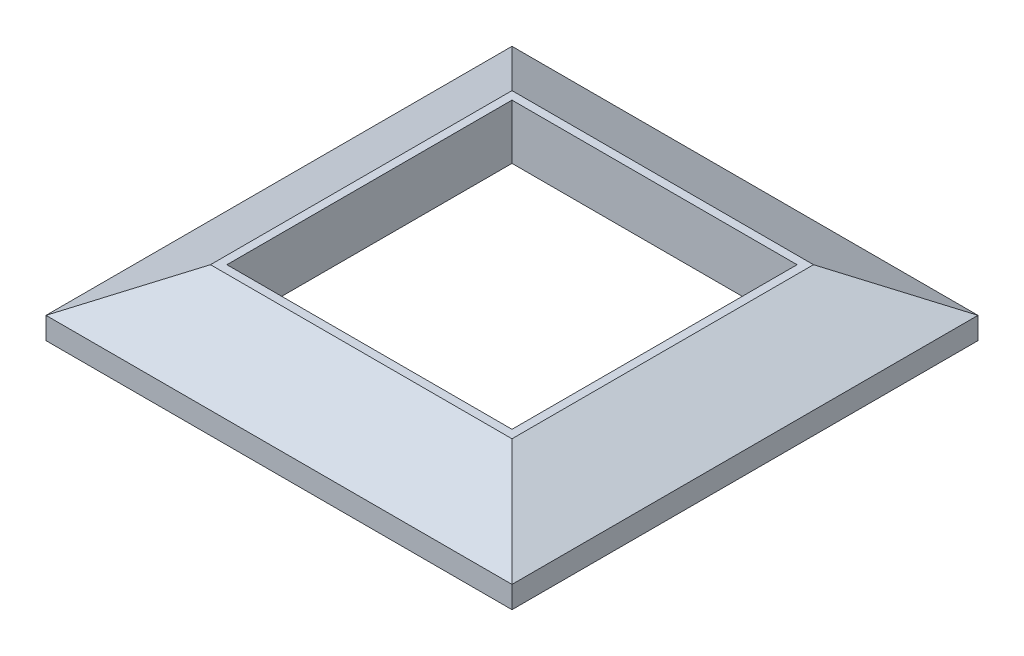
ISO-10303-21;
HEADER;
FILE_DESCRIPTION(('STEP AP214'),'2;1');
FILE_NAME('part.step','',(''),(''),'','','');
FILE_SCHEMA(('AUTOMOTIVE_DESIGN { 1 0 10303 214 1 1 1 1 }'));
ENDSEC;
DATA;
#1=APPLICATION_CONTEXT('core data for automotive mechanical design processes');
#2=APPLICATION_PROTOCOL_DEFINITION('international standard','automotive_design',2000,#1);
#3=PRODUCT_CONTEXT('',#1,'mechanical');
#4=PRODUCT('Part','Part','',(#3));
#5=PRODUCT_RELATED_PRODUCT_CATEGORY('part','',(#4));
#6=PRODUCT_DEFINITION_FORMATION('','',#4);
#7=PRODUCT_DEFINITION_CONTEXT('part definition',#1,'design');
#8=PRODUCT_DEFINITION('design','',#6,#7);
#9=PRODUCT_DEFINITION_SHAPE('','',#8);
#10=(LENGTH_UNIT() NAMED_UNIT(*) SI_UNIT(.MILLI.,.METRE.));
#11=(NAMED_UNIT(*) PLANE_ANGLE_UNIT() SI_UNIT($,.RADIAN.));
#12=(NAMED_UNIT(*) SI_UNIT($,.STERADIAN.) SOLID_ANGLE_UNIT());
#13=UNCERTAINTY_MEASURE_WITH_UNIT(LENGTH_MEASURE(1.E-05),#10,'distance_accuracy_value','');
#14=(GEOMETRIC_REPRESENTATION_CONTEXT(3) GLOBAL_UNCERTAINTY_ASSIGNED_CONTEXT((#13)) GLOBAL_UNIT_ASSIGNED_CONTEXT((#10,
#11,#12)) REPRESENTATION_CONTEXT('',''));
#15=CARTESIAN_POINT('',(0.,0.,0.));
#16=DIRECTION('',(0.,0.,1.));
#17=DIRECTION('',(1.,0.,0.));
#18=AXIS2_PLACEMENT_3D('',#15,#16,#17);
#19=CARTESIAN_POINT('',(-16.5,12.,26.));
#20=DIRECTION('',(1.,0.,0.));
#21=DIRECTION('',(0.,0.,-1.));
#22=AXIS2_PLACEMENT_3D('',#19,#20,#21);
#23=PLANE('',#22);
#24=DIRECTION('',(0.,0.,-1.));
#25=VECTOR('',#24,1.);
#26=CARTESIAN_POINT('',(-16.5,2.,26.));
#27=LINE('',#26,#25);
#28=CARTESIAN_POINT('',(-16.5,2.,26.));
#29=VERTEX_POINT('',#28);
#30=CARTESIAN_POINT('',(-16.5,2.,-26.));
#31=VERTEX_POINT('',#30);
#32=EDGE_CURVE('E196',#29,#31,#27,.T.);
#33=ORIENTED_EDGE('',*,*,#32,.F.);
#34=DIRECTION('',(0.,-1.,0.));
#35=VECTOR('',#34,1.);
#36=CARTESIAN_POINT('',(-16.5,12.,26.));
#37=LINE('',#36,#35);
#38=CARTESIAN_POINT('',(-16.5,12.,26.));
#39=VERTEX_POINT('',#38);
#40=EDGE_CURVE('E215',#39,#29,#37,.T.);
#41=ORIENTED_EDGE('',*,*,#40,.F.);
#42=DIRECTION('',(0.,0.,1.));
#43=VECTOR('',#42,1.);
#44=CARTESIAN_POINT('',(-16.5,12.,26.));
#45=LINE('',#44,#43);
#46=CARTESIAN_POINT('',(-16.5,12.,-26.));
#47=VERTEX_POINT('',#46);
#48=EDGE_CURVE('E199',#47,#39,#45,.T.);
#49=ORIENTED_EDGE('',*,*,#48,.F.);
#50=DIRECTION('',(0.,-1.,0.));
#51=VECTOR('',#50,1.);
#52=CARTESIAN_POINT('',(-16.5,12.,-26.));
#53=LINE('',#52,#51);
#54=EDGE_CURVE('E216',#47,#31,#53,.T.);
#55=ORIENTED_EDGE('',*,*,#54,.T.);
#56=EDGE_LOOP('',(#33,#41,#49,#55));
#57=FACE_BOUND('',#56,.T.);
#58=ADVANCED_FACE('F40',(#57),#23,.F.);
#59=CARTESIAN_POINT('',(-68.5,12.,-26.));
#60=DIRECTION('',(0.,0.,-1.));
#61=DIRECTION('',(-1.,0.,0.));
#62=AXIS2_PLACEMENT_3D('',#59,#60,#61);
#63=PLANE('',#62);
#64=DIRECTION('',(-1.,0.,0.));
#65=VECTOR('',#64,1.);
#66=CARTESIAN_POINT('',(-68.5,2.,-26.));
#67=LINE('',#66,#65);
#68=CARTESIAN_POINT('',(-68.5,2.,-26.));
#69=VERTEX_POINT('',#68);
#70=EDGE_CURVE('E193',#31,#69,#67,.T.);
#71=ORIENTED_EDGE('',*,*,#70,.F.);
#72=ORIENTED_EDGE('',*,*,#54,.F.);
#73=DIRECTION('',(1.,0.,0.));
#74=VECTOR('',#73,1.);
#75=CARTESIAN_POINT('',(-68.5,12.,-26.));
#76=LINE('',#75,#74);
#77=CARTESIAN_POINT('',(-68.5,12.,-26.));
#78=VERTEX_POINT('',#77);
#79=EDGE_CURVE('E211',#78,#47,#76,.T.);
#80=ORIENTED_EDGE('',*,*,#79,.F.);
#81=DIRECTION('',(0.,-1.,0.));
#82=VECTOR('',#81,1.);
#83=CARTESIAN_POINT('',(-68.5,12.,-26.));
#84=LINE('',#83,#82);
#85=EDGE_CURVE('E221',#78,#69,#84,.T.);
#86=ORIENTED_EDGE('',*,*,#85,.T.);
#87=EDGE_LOOP('',(#71,#72,#80,#86));
#88=FACE_BOUND('',#87,.T.);
#89=ADVANCED_FACE('F345',(#88),#63,.F.);
#90=CARTESIAN_POINT('',(-68.5,12.,26.));
#91=DIRECTION('',(-1.,0.,0.));
#92=DIRECTION('',(0.,0.,1.));
#93=AXIS2_PLACEMENT_3D('',#90,#91,#92);
#94=PLANE('',#93);
#95=DIRECTION('',(0.,0.,1.));
#96=VECTOR('',#95,1.);
#97=CARTESIAN_POINT('',(-68.5,2.,26.));
#98=LINE('',#97,#96);
#99=CARTESIAN_POINT('',(-68.5,2.,26.));
#100=VERTEX_POINT('',#99);
#101=EDGE_CURVE('E63',#69,#100,#98,.T.);
#102=ORIENTED_EDGE('',*,*,#101,.F.);
#103=ORIENTED_EDGE('',*,*,#85,.F.);
#104=DIRECTION('',(0.,0.,-1.));
#105=VECTOR('',#104,1.);
#106=CARTESIAN_POINT('',(-68.5,12.,26.));
#107=LINE('',#106,#105);
#108=CARTESIAN_POINT('',(-68.5,12.,26.));
#109=VERTEX_POINT('',#108);
#110=EDGE_CURVE('E207',#109,#78,#107,.T.);
#111=ORIENTED_EDGE('',*,*,#110,.F.);
#112=DIRECTION('',(0.,-1.,0.));
#113=VECTOR('',#112,1.);
#114=CARTESIAN_POINT('',(-68.5,12.,26.));
#115=LINE('',#114,#113);
#116=EDGE_CURVE('E225',#109,#100,#115,.T.);
#117=ORIENTED_EDGE('',*,*,#116,.T.);
#118=EDGE_LOOP('',(#102,#103,#111,#117));
#119=FACE_BOUND('',#118,.T.);
#120=ADVANCED_FACE('F351',(#119),#94,.F.);
#121=CARTESIAN_POINT('',(-68.5,12.,26.));
#122=DIRECTION('',(0.,0.,1.));
#123=DIRECTION('',(1.,0.,0.));
#124=AXIS2_PLACEMENT_3D('',#121,#122,#123);
#125=PLANE('',#124);
#126=DIRECTION('',(1.,0.,0.));
#127=VECTOR('',#126,1.);
#128=CARTESIAN_POINT('',(-68.5,2.,26.));
#129=LINE('',#128,#127);
#130=EDGE_CURVE('E12',#100,#29,#129,.T.);
#131=ORIENTED_EDGE('',*,*,#130,.F.);
#132=ORIENTED_EDGE('',*,*,#116,.F.);
#133=DIRECTION('',(-1.,0.,0.));
#134=VECTOR('',#133,1.);
#135=CARTESIAN_POINT('',(-68.5,12.,26.));
#136=LINE('',#135,#134);
#137=EDGE_CURVE('E203',#39,#109,#136,.T.);
#138=ORIENTED_EDGE('',*,*,#137,.F.);
#139=ORIENTED_EDGE('',*,*,#40,.T.);
#140=EDGE_LOOP('',(#131,#132,#138,#139));
#141=FACE_BOUND('',#140,.T.);
#142=ADVANCED_FACE('F357',(#141),#125,.F.);
#143=CARTESIAN_POINT('',(0.,4.,42.5));
#144=DIRECTION('',(-0.470588235294118,-0.882352941176471,0.));
#145=DIRECTION('',(0.882352941176471,-0.470588235294118,0.));
#146=AXIS2_PLACEMENT_3D('',#143,#144,#145);
#147=PLANE('',#146);
#148=DIRECTION('',(-0.661621637086846,0.352864873112985,-0.661621637086847));
#149=VECTOR('',#148,1.);
#150=CARTESIAN_POINT('',(0.,4.,42.5));
#151=LINE('',#150,#149);
#152=CARTESIAN_POINT('',(0.,4.,42.5));
#153=VERTEX_POINT('',#152);
#154=CARTESIAN_POINT('',(-15.,12.,27.5));
#155=VERTEX_POINT('',#154);
#156=EDGE_CURVE('E254',#153,#155,#151,.T.);
#157=ORIENTED_EDGE('',*,*,#156,.F.);
#158=DIRECTION('',(0.,0.,-1.));
#159=VECTOR('',#158,1.);
#160=CARTESIAN_POINT('',(0.,4.,42.5));
#161=LINE('',#160,#159);
#162=CARTESIAN_POINT('',(0.,4.,-42.5));
#163=VERTEX_POINT('',#162);
#164=EDGE_CURVE('E269',#153,#163,#161,.T.);
#165=ORIENTED_EDGE('',*,*,#164,.T.);
#166=DIRECTION('',(0.661621637086846,-0.352864873112985,-0.661621637086847));
#167=VECTOR('',#166,1.);
#168=CARTESIAN_POINT('',(-37.2081712062257,23.8443579766537,-5.29182879377429));
#169=LINE('',#168,#167);
#170=CARTESIAN_POINT('',(-15.,12.,-27.5));
#171=VERTEX_POINT('',#170);
#172=EDGE_CURVE('E248',#171,#163,#169,.T.);
#173=ORIENTED_EDGE('',*,*,#172,.F.);
#174=DIRECTION('',(0.,0.,-1.));
#175=VECTOR('',#174,1.);
#176=CARTESIAN_POINT('',(-15.,12.,42.5));
#177=LINE('',#176,#175);
#178=EDGE_CURVE('E49',#155,#171,#177,.T.);
#179=ORIENTED_EDGE('',*,*,#178,.F.);
#180=EDGE_LOOP('',(#157,#165,#173,#179));
#181=FACE_BOUND('',#180,.T.);
#182=ADVANCED_FACE('F42',(#181),#147,.F.);
#183=CARTESIAN_POINT('',(-70.,12.,42.5));
#184=DIRECTION('',(0.,-1.,0.));
#185=DIRECTION('',(0.,0.,-1.));
#186=AXIS2_PLACEMENT_3D('',#183,#184,#185);
#187=PLANE('',#186);
#188=ORIENTED_EDGE('',*,*,#79,.T.);
#189=ORIENTED_EDGE('',*,*,#48,.T.);
#190=ORIENTED_EDGE('',*,*,#137,.T.);
#191=ORIENTED_EDGE('',*,*,#110,.T.);
#192=EDGE_LOOP('',(#188,#189,#190,#191));
#193=FACE_BOUND('',#192,.T.);
#194=DIRECTION('',(1.,0.,0.));
#195=VECTOR('',#194,1.);
#196=CARTESIAN_POINT('',(-85.,12.,27.5));
#197=LINE('',#196,#195);
#198=CARTESIAN_POINT('',(-70.,12.,27.5));
#199=VERTEX_POINT('',#198);
#200=EDGE_CURVE('E232',#199,#155,#197,.T.);
#201=ORIENTED_EDGE('',*,*,#200,.T.);
#202=ORIENTED_EDGE('',*,*,#178,.T.);
#203=DIRECTION('',(1.,0.,0.));
#204=VECTOR('',#203,1.);
#205=CARTESIAN_POINT('',(-85.,12.,-27.5));
#206=LINE('',#205,#204);
#207=CARTESIAN_POINT('',(-70.,12.,-27.5));
#208=VERTEX_POINT('',#207);
#209=EDGE_CURVE('E237',#208,#171,#206,.T.);
#210=ORIENTED_EDGE('',*,*,#209,.F.);
#211=DIRECTION('',(0.,0.,-1.));
#212=VECTOR('',#211,1.);
#213=CARTESIAN_POINT('',(-70.,12.,42.5));
#214=LINE('',#213,#212);
#215=EDGE_CURVE('E293',#199,#208,#214,.T.);
#216=ORIENTED_EDGE('',*,*,#215,.F.);
#217=EDGE_LOOP('',(#201,#202,#210,#216));
#218=FACE_BOUND('',#217,.T.);
#219=ADVANCED_FACE('F301',(#193,#218),#187,.F.);
#220=CARTESIAN_POINT('',(-85.,4.,42.5));
#221=DIRECTION('',(0.470588235294118,-0.882352941176471,0.));
#222=DIRECTION('',(0.882352941176471,0.470588235294118,0.));
#223=AXIS2_PLACEMENT_3D('',#220,#221,#222);
#224=PLANE('',#223);
#225=DIRECTION('',(-0.661621637086846,-0.352864873112985,0.661621637086847));
#226=VECTOR('',#225,1.);
#227=CARTESIAN_POINT('',(-85.,4.,42.5));
#228=LINE('',#227,#226);
#229=CARTESIAN_POINT('',(-85.,4.,42.5));
#230=VERTEX_POINT('',#229);
#231=EDGE_CURVE('E251',#199,#230,#228,.T.);
#232=ORIENTED_EDGE('',*,*,#231,.F.);
#233=ORIENTED_EDGE('',*,*,#215,.T.);
#234=DIRECTION('',(0.661621637086846,0.352864873112985,0.661621637086847));
#235=VECTOR('',#234,1.);
#236=CARTESIAN_POINT('',(-47.7918287937743,23.8443579766537,-5.29182879377429));
#237=LINE('',#236,#235);
#238=CARTESIAN_POINT('',(-85.,4.00000000000001,-42.5));
#239=VERTEX_POINT('',#238);
#240=EDGE_CURVE('E236',#239,#208,#237,.T.);
#241=ORIENTED_EDGE('',*,*,#240,.F.);
#242=DIRECTION('',(0.,0.,-1.));
#243=VECTOR('',#242,1.);
#244=CARTESIAN_POINT('',(-85.,4.,42.5));
#245=LINE('',#244,#243);
#246=EDGE_CURVE('E289',#230,#239,#245,.T.);
#247=ORIENTED_EDGE('',*,*,#246,.F.);
#248=EDGE_LOOP('',(#232,#233,#241,#247));
#249=FACE_BOUND('',#248,.T.);
#250=ADVANCED_FACE('F329',(#249),#224,.F.);
#251=CARTESIAN_POINT('',(0.,0.,42.5));
#252=DIRECTION('',(0.,0.,-1.));
#253=DIRECTION('',(-1.,0.,0.));
#254=AXIS2_PLACEMENT_3D('',#251,#252,#253);
#255=PLANE('',#254);
#256=DIRECTION('',(1.,0.,0.));
#257=VECTOR('',#256,1.);
#258=CARTESIAN_POINT('',(-85.,4.,42.5));
#259=LINE('',#258,#257);
#260=EDGE_CURVE('E220',#230,#153,#259,.T.);
#261=ORIENTED_EDGE('',*,*,#260,.F.);
#262=DIRECTION('',(0.,-1.,0.));
#263=VECTOR('',#262,1.);
#264=CARTESIAN_POINT('',(-85.,0.,42.5));
#265=LINE('',#264,#263);
#266=CARTESIAN_POINT('',(-85.,0.,42.5));
#267=VERTEX_POINT('',#266);
#268=EDGE_CURVE('E258',#230,#267,#265,.T.);
#269=ORIENTED_EDGE('',*,*,#268,.T.);
#270=DIRECTION('',(1.,0.,0.));
#271=VECTOR('',#270,1.);
#272=CARTESIAN_POINT('',(0.,0.,42.5));
#273=LINE('',#272,#271);
#274=CARTESIAN_POINT('',(0.,0.,42.5));
#275=VERTEX_POINT('',#274);
#276=EDGE_CURVE('E261',#267,#275,#273,.T.);
#277=ORIENTED_EDGE('',*,*,#276,.T.);
#278=DIRECTION('',(0.,1.,0.));
#279=VECTOR('',#278,1.);
#280=CARTESIAN_POINT('',(0.,0.,42.5));
#281=LINE('',#280,#279);
#282=EDGE_CURVE('E265',#275,#153,#281,.T.);
#283=ORIENTED_EDGE('',*,*,#282,.T.);
#284=EDGE_LOOP('',(#261,#269,#277,#283));
#285=FACE_BOUND('',#284,.T.);
#286=ADVANCED_FACE('F334',(#285),#255,.F.);
#287=CARTESIAN_POINT('',(0.,0.,-42.5));
#288=DIRECTION('',(0.,0.,-1.));
#289=DIRECTION('',(-1.,0.,0.));
#290=AXIS2_PLACEMENT_3D('',#287,#288,#289);
#291=PLANE('',#290);
#292=DIRECTION('',(0.,-1.,0.));
#293=VECTOR('',#292,1.);
#294=CARTESIAN_POINT('',(-85.,0.,-42.5));
#295=LINE('',#294,#293);
#296=CARTESIAN_POINT('',(-85.,0.,-42.5));
#297=VERTEX_POINT('',#296);
#298=EDGE_CURVE('E257',#239,#297,#295,.T.);
#299=ORIENTED_EDGE('',*,*,#298,.F.);
#300=DIRECTION('',(1.,0.,0.));
#301=VECTOR('',#300,1.);
#302=CARTESIAN_POINT('',(-85.,4.00000000000001,-42.5));
#303=LINE('',#302,#301);
#304=EDGE_CURVE('E240',#239,#163,#303,.T.);
#305=ORIENTED_EDGE('',*,*,#304,.T.);
#306=DIRECTION('',(0.,1.,0.));
#307=VECTOR('',#306,1.);
#308=CARTESIAN_POINT('',(0.,0.,-42.5));
#309=LINE('',#308,#307);
#310=CARTESIAN_POINT('',(0.,0.,-42.5));
#311=VERTEX_POINT('',#310);
#312=EDGE_CURVE('E262',#311,#163,#309,.T.);
#313=ORIENTED_EDGE('',*,*,#312,.F.);
#314=DIRECTION('',(1.,0.,0.));
#315=VECTOR('',#314,1.);
#316=CARTESIAN_POINT('',(0.,0.,-42.5));
#317=LINE('',#316,#315);
#318=EDGE_CURVE('E272',#297,#311,#317,.T.);
#319=ORIENTED_EDGE('',*,*,#318,.F.);
#320=EDGE_LOOP('',(#299,#305,#313,#319));
#321=FACE_BOUND('',#320,.T.);
#322=ADVANCED_FACE('F313',(#321),#291,.T.);
#323=CARTESIAN_POINT('',(-85.,0.,42.5));
#324=DIRECTION('',(1.,0.,0.));
#325=DIRECTION('',(0.,0.,-1.));
#326=AXIS2_PLACEMENT_3D('',#323,#324,#325);
#327=PLANE('',#326);
#328=ORIENTED_EDGE('',*,*,#298,.T.);
#329=DIRECTION('',(0.,0.,-1.));
#330=VECTOR('',#329,1.);
#331=CARTESIAN_POINT('',(-85.,0.,42.5));
#332=LINE('',#331,#330);
#333=EDGE_CURVE('E285',#267,#297,#332,.T.);
#334=ORIENTED_EDGE('',*,*,#333,.F.);
#335=ORIENTED_EDGE('',*,*,#268,.F.);
#336=ORIENTED_EDGE('',*,*,#246,.T.);
#337=EDGE_LOOP('',(#328,#334,#335,#336));
#338=FACE_BOUND('',#337,.T.);
#339=ADVANCED_FACE('F325',(#338),#327,.F.);
#340=CARTESIAN_POINT('',(0.,0.,42.5));
#341=DIRECTION('',(0.,1.,0.));
#342=DIRECTION('',(-1.,0.,0.));
#343=AXIS2_PLACEMENT_3D('',#340,#341,#342);
#344=PLANE('',#343);
#345=DIRECTION('',(1.,0.,0.));
#346=VECTOR('',#345,1.);
#347=CARTESIAN_POINT('',(-83.5,0.,-41.));
#348=LINE('',#347,#346);
#349=CARTESIAN_POINT('',(-83.5,0.,-41.));
#350=VERTEX_POINT('',#349);
#351=CARTESIAN_POINT('',(-1.49999999999999,0.,-41.));
#352=VERTEX_POINT('',#351);
#353=EDGE_CURVE('E177',#350,#352,#348,.T.);
#354=ORIENTED_EDGE('',*,*,#353,.F.);
#355=DIRECTION('',(0.,0.,-1.));
#356=VECTOR('',#355,1.);
#357=CARTESIAN_POINT('',(-83.5,0.,41.));
#358=LINE('',#357,#356);
#359=CARTESIAN_POINT('',(-83.5,0.,41.));
#360=VERTEX_POINT('',#359);
#361=EDGE_CURVE('E56',#360,#350,#358,.T.);
#362=ORIENTED_EDGE('',*,*,#361,.F.);
#363=DIRECTION('',(-1.,0.,0.));
#364=VECTOR('',#363,1.);
#365=CARTESIAN_POINT('',(-83.5,0.,41.));
#366=LINE('',#365,#364);
#367=CARTESIAN_POINT('',(-1.5,0.,41.));
#368=VERTEX_POINT('',#367);
#369=EDGE_CURVE('E164',#368,#360,#366,.T.);
#370=ORIENTED_EDGE('',*,*,#369,.F.);
#371=DIRECTION('',(0.,0.,1.));
#372=VECTOR('',#371,1.);
#373=CARTESIAN_POINT('',(-1.5,0.,41.));
#374=LINE('',#373,#372);
#375=EDGE_CURVE('E168',#352,#368,#374,.T.);
#376=ORIENTED_EDGE('',*,*,#375,.F.);
#377=EDGE_LOOP('',(#354,#362,#370,#376));
#378=FACE_BOUND('',#377,.T.);
#379=ORIENTED_EDGE('',*,*,#318,.T.);
#380=DIRECTION('',(0.,0.,-1.));
#381=VECTOR('',#380,1.);
#382=CARTESIAN_POINT('',(0.,0.,42.5));
#383=LINE('',#382,#381);
#384=EDGE_CURVE('E281',#275,#311,#383,.T.);
#385=ORIENTED_EDGE('',*,*,#384,.F.);
#386=ORIENTED_EDGE('',*,*,#276,.F.);
#387=ORIENTED_EDGE('',*,*,#333,.T.);
#388=EDGE_LOOP('',(#379,#385,#386,#387));
#389=FACE_BOUND('',#388,.T.);
#390=ADVANCED_FACE('F321',(#378,#389),#344,.F.);
#391=CARTESIAN_POINT('',(0.,0.,42.5));
#392=DIRECTION('',(-1.,0.,0.));
#393=DIRECTION('',(0.,0.,1.));
#394=AXIS2_PLACEMENT_3D('',#391,#392,#393);
#395=PLANE('',#394);
#396=ORIENTED_EDGE('',*,*,#312,.T.);
#397=ORIENTED_EDGE('',*,*,#164,.F.);
#398=ORIENTED_EDGE('',*,*,#282,.F.);
#399=ORIENTED_EDGE('',*,*,#384,.T.);
#400=EDGE_LOOP('',(#396,#397,#398,#399));
#401=FACE_BOUND('',#400,.T.);
#402=ADVANCED_FACE('F316',(#401),#395,.F.);
#403=CARTESIAN_POINT('',(-85.,4.00000000000001,-42.5));
#404=DIRECTION('',(0.,0.882352941176471,-0.470588235294117));
#405=DIRECTION('',(0.,0.470588235294117,0.882352941176471));
#406=AXIS2_PLACEMENT_3D('',#403,#404,#405);
#407=PLANE('',#406);
#408=ORIENTED_EDGE('',*,*,#172,.T.);
#409=ORIENTED_EDGE('',*,*,#304,.F.);
#410=ORIENTED_EDGE('',*,*,#240,.T.);
#411=ORIENTED_EDGE('',*,*,#209,.T.);
#412=EDGE_LOOP('',(#408,#409,#410,#411));
#413=FACE_BOUND('',#412,.T.);
#414=ADVANCED_FACE('F308',(#413),#407,.T.);
#415=CARTESIAN_POINT('',(-85.,4.,42.5));
#416=DIRECTION('',(0.,0.882352941176471,0.470588235294118));
#417=DIRECTION('',(0.,-0.470588235294118,0.882352941176471));
#418=AXIS2_PLACEMENT_3D('',#415,#416,#417);
#419=PLANE('',#418);
#420=ORIENTED_EDGE('',*,*,#156,.T.);
#421=ORIENTED_EDGE('',*,*,#200,.F.);
#422=ORIENTED_EDGE('',*,*,#231,.T.);
#423=ORIENTED_EDGE('',*,*,#260,.T.);
#424=EDGE_LOOP('',(#420,#421,#422,#423));
#425=FACE_BOUND('',#424,.T.);
#426=ADVANCED_FACE('F332',(#425),#419,.T.);
#427=CARTESIAN_POINT('',(0.,2.,0.));
#428=DIRECTION('',(0.,-1.,0.));
#429=DIRECTION('',(0.,0.,-1.));
#430=AXIS2_PLACEMENT_3D('',#427,#428,#429);
#431=PLANE('',#430);
#432=DIRECTION('',(0.,0.,-1.));
#433=VECTOR('',#432,1.);
#434=CARTESIAN_POINT('',(-83.5,2.,41.));
#435=LINE('',#434,#433);
#436=CARTESIAN_POINT('',(-83.5,2.,41.));
#437=VERTEX_POINT('',#436);
#438=CARTESIAN_POINT('',(-83.5,2.,-41.));
#439=VERTEX_POINT('',#438);
#440=EDGE_CURVE('E143',#437,#439,#435,.T.);
#441=ORIENTED_EDGE('',*,*,#440,.T.);
#442=DIRECTION('',(1.,0.,0.));
#443=VECTOR('',#442,1.);
#444=CARTESIAN_POINT('',(-83.5,2.,-41.));
#445=LINE('',#444,#443);
#446=CARTESIAN_POINT('',(-1.49999999999999,2.,-41.));
#447=VERTEX_POINT('',#446);
#448=EDGE_CURVE('E153',#439,#447,#445,.T.);
#449=ORIENTED_EDGE('',*,*,#448,.T.);
#450=DIRECTION('',(0.,0.,1.));
#451=VECTOR('',#450,1.);
#452=CARTESIAN_POINT('',(-1.5,2.,41.));
#453=LINE('',#452,#451);
#454=CARTESIAN_POINT('',(-1.5,2.,41.));
#455=VERTEX_POINT('',#454);
#456=EDGE_CURVE('E159',#447,#455,#453,.T.);
#457=ORIENTED_EDGE('',*,*,#456,.T.);
#458=DIRECTION('',(-1.,0.,0.));
#459=VECTOR('',#458,1.);
#460=CARTESIAN_POINT('',(-83.5,2.,41.));
#461=LINE('',#460,#459);
#462=EDGE_CURVE('E150',#455,#437,#461,.T.);
#463=ORIENTED_EDGE('',*,*,#462,.T.);
#464=EDGE_LOOP('',(#441,#449,#457,#463));
#465=FACE_BOUND('',#464,.T.);
#466=ORIENTED_EDGE('',*,*,#32,.T.);
#467=ORIENTED_EDGE('',*,*,#70,.T.);
#468=ORIENTED_EDGE('',*,*,#101,.T.);
#469=ORIENTED_EDGE('',*,*,#130,.T.);
#470=EDGE_LOOP('',(#466,#467,#468,#469));
#471=FACE_BOUND('',#470,.T.);
#472=ADVANCED_FACE('F161',(#465,#471),#431,.T.);
#473=CARTESIAN_POINT('',(-83.5,2.,41.));
#474=DIRECTION('',(-1.,0.,0.));
#475=DIRECTION('',(0.,0.,1.));
#476=AXIS2_PLACEMENT_3D('',#473,#474,#475);
#477=PLANE('',#476);
#478=ORIENTED_EDGE('',*,*,#361,.T.);
#479=DIRECTION('',(0.,-1.,0.));
#480=VECTOR('',#479,1.);
#481=CARTESIAN_POINT('',(-83.5,2.,-41.));
#482=LINE('',#481,#480);
#483=EDGE_CURVE('E139',#439,#350,#482,.T.);
#484=ORIENTED_EDGE('',*,*,#483,.F.);
#485=ORIENTED_EDGE('',*,*,#440,.F.);
#486=DIRECTION('',(0.,-1.,0.));
#487=VECTOR('',#486,1.);
#488=CARTESIAN_POINT('',(-83.5,2.,41.));
#489=LINE('',#488,#487);
#490=EDGE_CURVE('E183',#437,#360,#489,.T.);
#491=ORIENTED_EDGE('',*,*,#490,.T.);
#492=EDGE_LOOP('',(#478,#484,#485,#491));
#493=FACE_BOUND('',#492,.T.);
#494=ADVANCED_FACE('F141',(#493),#477,.F.);
#495=CARTESIAN_POINT('',(-83.5,2.,41.));
#496=DIRECTION('',(0.,0.,1.));
#497=DIRECTION('',(1.,0.,0.));
#498=AXIS2_PLACEMENT_3D('',#495,#496,#497);
#499=PLANE('',#498);
#500=ORIENTED_EDGE('',*,*,#369,.T.);
#501=ORIENTED_EDGE('',*,*,#490,.F.);
#502=ORIENTED_EDGE('',*,*,#462,.F.);
#503=DIRECTION('',(0.,-1.,0.));
#504=VECTOR('',#503,1.);
#505=CARTESIAN_POINT('',(-1.5,2.,41.));
#506=LINE('',#505,#504);
#507=EDGE_CURVE('E186',#455,#368,#506,.T.);
#508=ORIENTED_EDGE('',*,*,#507,.T.);
#509=EDGE_LOOP('',(#500,#501,#502,#508));
#510=FACE_BOUND('',#509,.T.);
#511=ADVANCED_FACE('F368',(#510),#499,.F.);
#512=CARTESIAN_POINT('',(-1.5,2.,41.));
#513=DIRECTION('',(1.,0.,0.));
#514=DIRECTION('',(0.,0.,-1.));
#515=AXIS2_PLACEMENT_3D('',#512,#513,#514);
#516=PLANE('',#515);
#517=ORIENTED_EDGE('',*,*,#375,.T.);
#518=ORIENTED_EDGE('',*,*,#507,.F.);
#519=ORIENTED_EDGE('',*,*,#456,.F.);
#520=DIRECTION('',(0.,-1.,0.));
#521=VECTOR('',#520,1.);
#522=CARTESIAN_POINT('',(-1.49999999999999,2.,-41.));
#523=LINE('',#522,#521);
#524=EDGE_CURVE('E149',#447,#352,#523,.T.);
#525=ORIENTED_EDGE('',*,*,#524,.T.);
#526=EDGE_LOOP('',(#517,#518,#519,#525));
#527=FACE_BOUND('',#526,.T.);
#528=ADVANCED_FACE('F373',(#527),#516,.F.);
#529=CARTESIAN_POINT('',(-83.5,2.,-41.));
#530=DIRECTION('',(0.,0.,-1.));
#531=DIRECTION('',(-1.,0.,0.));
#532=AXIS2_PLACEMENT_3D('',#529,#530,#531);
#533=PLANE('',#532);
#534=ORIENTED_EDGE('',*,*,#353,.T.);
#535=ORIENTED_EDGE('',*,*,#524,.F.);
#536=ORIENTED_EDGE('',*,*,#448,.F.);
#537=ORIENTED_EDGE('',*,*,#483,.T.);
#538=EDGE_LOOP('',(#534,#535,#536,#537));
#539=FACE_BOUND('',#538,.T.);
#540=ADVANCED_FACE('F154',(#539),#533,.F.);
#541=CLOSED_SHELL('',(#58,#89,#120,#142,#182,#219,#250,#286,#322,#339,#390,#402,#414,#426,#472,
#494,#511,#528,#540));
#542=MANIFOLD_SOLID_BREP('B2',#541);
#543=ADVANCED_BREP_SHAPE_REPRESENTATION('',(#18,#542),#14);
#544=SHAPE_DEFINITION_REPRESENTATION(#9,#543);
ENDSEC;
END-ISO-10303-21;
